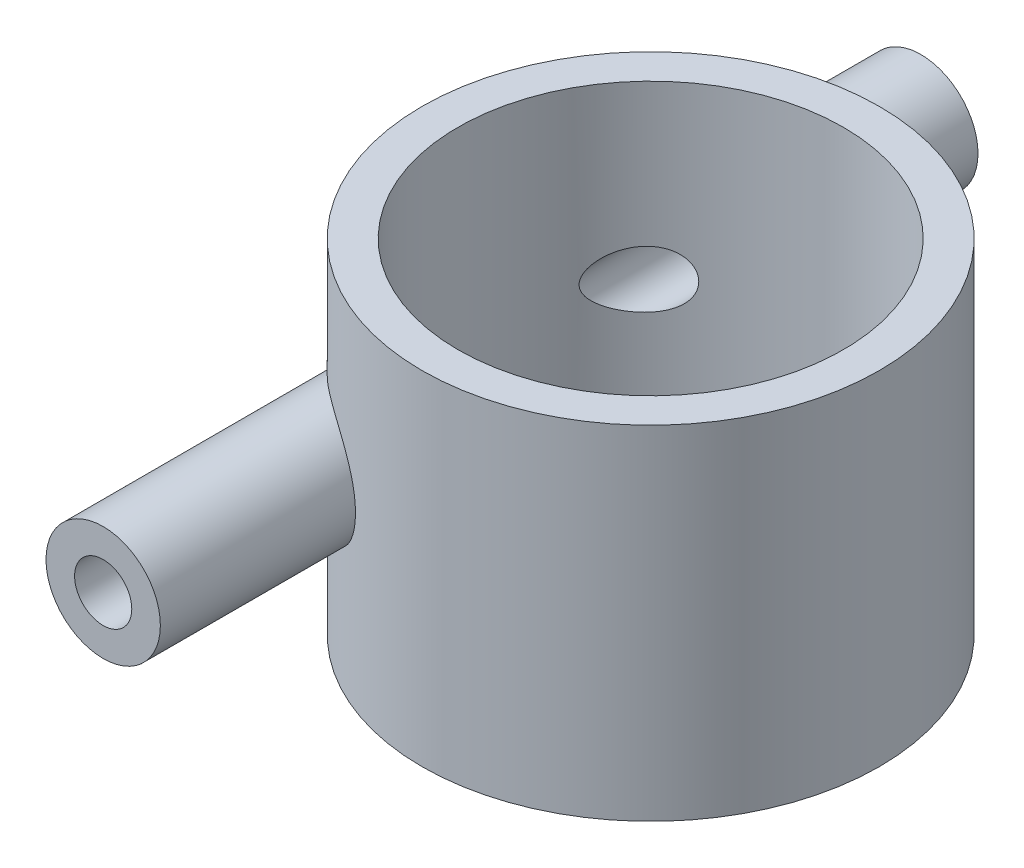
ISO-10303-21;
HEADER;
FILE_DESCRIPTION(('STEP AP214'),'2;1');
FILE_NAME('part.step','',(''),(''),'','','');
FILE_SCHEMA(('AUTOMOTIVE_DESIGN { 1 0 10303 214 1 1 1 1 }'));
ENDSEC;
DATA;
#1=APPLICATION_CONTEXT('core data for automotive mechanical design processes');
#2=APPLICATION_PROTOCOL_DEFINITION('international standard','automotive_design',2000,#1);
#3=PRODUCT_CONTEXT('',#1,'mechanical');
#4=PRODUCT('Part','Part','',(#3));
#5=PRODUCT_RELATED_PRODUCT_CATEGORY('part','',(#4));
#6=PRODUCT_DEFINITION_FORMATION('','',#4);
#7=PRODUCT_DEFINITION_CONTEXT('part definition',#1,'design');
#8=PRODUCT_DEFINITION('design','',#6,#7);
#9=PRODUCT_DEFINITION_SHAPE('','',#8);
#10=(LENGTH_UNIT() NAMED_UNIT(*) SI_UNIT(.MILLI.,.METRE.));
#11=(NAMED_UNIT(*) PLANE_ANGLE_UNIT() SI_UNIT($,.RADIAN.));
#12=(NAMED_UNIT(*) SI_UNIT($,.STERADIAN.) SOLID_ANGLE_UNIT());
#13=UNCERTAINTY_MEASURE_WITH_UNIT(LENGTH_MEASURE(1.E-05),#10,'distance_accuracy_value','');
#14=(GEOMETRIC_REPRESENTATION_CONTEXT(3) GLOBAL_UNCERTAINTY_ASSIGNED_CONTEXT((#13)) GLOBAL_UNIT_ASSIGNED_CONTEXT((#10,
#11,#12)) REPRESENTATION_CONTEXT('',''));
#15=CARTESIAN_POINT('',(0.,0.,0.));
#16=DIRECTION('',(0.,0.,1.));
#17=DIRECTION('',(1.,0.,0.));
#18=AXIS2_PLACEMENT_3D('',#15,#16,#17);
#19=CARTESIAN_POINT('',(0.,2.,0.));
#20=DIRECTION('',(0.,1.,0.));
#21=DIRECTION('',(0.,0.,1.));
#22=AXIS2_PLACEMENT_3D('',#19,#20,#21);
#23=CYLINDRICAL_SURFACE('',#22,10.7);
#24=CARTESIAN_POINT('',(-6.1125,9.525,8.78221747339474));
#25=CARTESIAN_POINT('',(-6.11250312254416,9.44825700080973,8.78221600533207));
#26=CARTESIAN_POINT('',(-6.118097707077,9.37148095001925,8.77832952546134));
#27=CARTESIAN_POINT('',(-6.14014624439313,9.2202680872524,8.76292057863401));
#28=CARTESIAN_POINT('',(-6.15660823273063,9.14583304896233,8.75139246128695));
#29=CARTESIAN_POINT('',(-6.19936098052003,9.00166951688379,8.72115814971002));
#30=CARTESIAN_POINT('',(-6.22562073033161,8.93192698485165,8.70247459734718));
#31=CARTESIAN_POINT('',(-6.28658154592039,8.79850895554664,8.65853903094098));
#32=CARTESIAN_POINT('',(-6.32128301684507,8.73483374966998,8.63328670163521));
#33=CARTESIAN_POINT('',(-6.3994598224086,8.61157622307415,8.57551064924828));
#34=CARTESIAN_POINT('',(-6.44328938104205,8.55236226492112,8.54268444189073));
#35=CARTESIAN_POINT('',(-6.53664661414861,8.44242114720817,8.47146442230904));
#36=CARTESIAN_POINT('',(-6.5861772633967,8.39169845249712,8.43306770069741));
#37=CARTESIAN_POINT('',(-6.71110319278224,8.27921485046292,8.3342538351227));
#38=CARTESIAN_POINT('',(-6.7885680721469,8.22187775658926,8.27139799755292));
#39=CARTESIAN_POINT('',(-6.94762084216152,8.12398507888238,8.13826727499792));
#40=CARTESIAN_POINT('',(-7.02921628051588,8.0834615586283,8.06797853267598));
#41=CARTESIAN_POINT('',(-7.22022952487831,8.00720148456525,7.8980643946847));
#42=CARTESIAN_POINT('',(-7.33007886489237,7.97729137827179,7.7963237898771));
#43=CARTESIAN_POINT('',(-7.54730108217441,7.94101684850117,7.58624966738823));
#44=CARTESIAN_POINT('',(-7.6546702976711,7.93468527287175,7.47790716569245));
#45=CARTESIAN_POINT('',(-7.82695206498514,7.94114427042855,7.29647069996284));
#46=CARTESIAN_POINT('',(-7.89339800652879,7.94794116341055,7.22452664697531));
#47=CARTESIAN_POINT('',(-8.02372055856718,7.96945394763684,7.07950553234341));
#48=CARTESIAN_POINT('',(-8.08759739126862,7.98416915242275,7.00642856944711));
#49=CARTESIAN_POINT('',(-8.21252985475377,8.02109835439512,6.85956767343639));
#50=CARTESIAN_POINT('',(-8.27358077957587,8.04332438218939,6.78578279179522));
#51=CARTESIAN_POINT('',(-8.39246382300987,8.09501697285372,6.63818671460316));
#52=CARTESIAN_POINT('',(-8.45029689335531,8.12448138074113,6.56437553340099));
#53=CARTESIAN_POINT('',(-8.55162512357,8.18423605307258,6.43158405370999));
#54=CARTESIAN_POINT('',(-8.59572945668235,8.21326358615959,6.37249731536299));
#55=CARTESIAN_POINT('',(-8.68150400754895,8.27614673141504,6.25513919448376));
#56=CARTESIAN_POINT('',(-8.72317472840425,8.31000134066538,6.1968676453351));
#57=CARTESIAN_POINT('',(-8.80374737377532,8.38270627402089,6.08185385469353));
#58=CARTESIAN_POINT('',(-8.84265725425359,8.42154125548262,6.0251075381991));
#59=CARTESIAN_POINT('',(-8.9175006003756,8.50471678579894,5.91376983766213));
#60=CARTESIAN_POINT('',(-8.95343632300431,8.54905309482773,5.85917683632136));
#61=CARTESIAN_POINT('',(-9.02013077288391,8.64154219394611,5.75593814489387));
#62=CARTESIAN_POINT('',(-9.05105914715668,8.6893899644181,5.70713138272459));
#63=CARTESIAN_POINT('',(-9.10910347717043,8.79149331197321,5.61402109706938));
#64=CARTESIAN_POINT('',(-9.13621987473754,8.84574814510394,5.56971705186243));
#65=CARTESIAN_POINT('',(-9.18136319412692,8.95187692903849,5.49492078927352));
#66=CARTESIAN_POINT('',(-9.2001517187026,9.0026560875438,5.46335636648559));
#67=CARTESIAN_POINT('',(-9.23314945339901,9.10941583542776,5.40740294007257));
#68=CARTESIAN_POINT('',(-9.24736881331456,9.16538453523171,5.3829980431617));
#69=CARTESIAN_POINT('',(-9.26703909950302,9.26710962039738,5.34904410110054));
#70=CARTESIAN_POINT('',(-9.2737980449472,9.31186983476457,5.33729902106589));
#71=CARTESIAN_POINT('',(-9.28346806398171,9.40302460875686,5.32046221755713));
#72=CARTESIAN_POINT('',(-9.28638341250137,9.44941729362729,5.31536310237331));
#73=CARTESIAN_POINT('',(-9.28808795320677,9.54264689305431,5.31238423611888));
#74=CARTESIAN_POINT('',(-9.28686571701582,9.58948468109958,5.31452448079022));
#75=CARTESIAN_POINT('',(-9.28039769296681,9.68202717332728,5.32581054490924));
#76=CARTESIAN_POINT('',(-9.27514844440529,9.72773086800803,5.33496238992403));
#77=CARTESIAN_POINT('',(-9.25940765953809,9.82754091658898,5.36224468478533));
#78=CARTESIAN_POINT('',(-9.24796330665905,9.8810460839269,5.38199784110397));
#79=CARTESIAN_POINT('',(-9.22072094100505,9.98369439393398,5.42853878586149));
#80=CARTESIAN_POINT('',(-9.20491384100954,10.0328281457153,5.45534125185065));
#81=CARTESIAN_POINT('',(-9.15960102465871,10.154343513761,5.53124025011146));
#82=CARTESIAN_POINT('',(-9.12751538791479,10.2233392309158,5.58416069773472));
#83=CARTESIAN_POINT('',(-9.05732531208008,10.3515500580938,5.69730946058455));
#84=CARTESIAN_POINT('',(-9.01920400539126,10.4107367772001,5.75755814292592));
#85=CARTESIAN_POINT('',(-8.9431479687853,10.5141092085981,5.87489591990046));
#86=CARTESIAN_POINT('',(-8.90573580170766,10.5592423855958,5.93150161825949));
#87=CARTESIAN_POINT('',(-8.8277949582927,10.6437228259516,6.0468908780888));
#88=CARTESIAN_POINT('',(-8.78726404241096,10.6830658712959,6.1056759885785));
#89=CARTESIAN_POINT('',(-8.70341128194668,10.7564323368033,6.22462314422241));
#90=CARTESIAN_POINT('',(-8.66008738284675,10.7904517763991,6.28478618151327));
#91=CARTESIAN_POINT('',(-8.57088690693405,10.8534175632849,6.40590036528584));
#92=CARTESIAN_POINT('',(-8.52500932149388,10.8823618870588,6.46685181576511));
#93=CARTESIAN_POINT('',(-8.4278455769129,10.9369843794155,6.5930384921221));
#94=CARTESIAN_POINT('',(-8.37640146480905,10.9623309492211,6.65829618409498));
#95=CARTESIAN_POINT('',(-8.27101973585621,11.0073548811838,6.78876176113054));
#96=CARTESIAN_POINT('',(-8.21708126092354,11.027030275314,6.85396962109007));
#97=CARTESIAN_POINT('',(-8.05190316100218,11.0772787844189,7.04880876992144));
#98=CARTESIAN_POINT('',(-7.93713508422537,11.0991676046229,7.1778719923353));
#99=CARTESIAN_POINT('',(-7.71432124606716,11.1158896481952,7.41638392815298));
#100=CARTESIAN_POINT('',(-7.60705500820879,11.1135832560016,7.52636343095351));
#101=CARTESIAN_POINT('',(-7.38934936587115,11.0856604051313,7.7401966325925));
#102=CARTESIAN_POINT('',(-7.27891382487403,11.0600712499003,7.84405735499491));
#103=CARTESIAN_POINT('',(-7.08616854910444,10.9916608224517,8.01802604447975));
#104=CARTESIAN_POINT('',(-7.00362831784109,10.9546332703483,8.0901484217593));
#105=CARTESIAN_POINT('',(-6.84193587057706,10.8638237702846,8.22733767400388));
#106=CARTESIAN_POINT('',(-6.7627789364571,10.8100660818133,8.29241458223543));
#107=CARTESIAN_POINT('',(-6.6263955948596,10.6970806161976,8.40160656609692));
#108=CARTESIAN_POINT('',(-6.56789998950395,10.6409556794284,8.44733597540694));
#109=CARTESIAN_POINT('',(-6.45807967617888,10.51727876038,8.5315878348748));
#110=CARTESIAN_POINT('',(-6.40675468648985,10.4497272272604,8.57011056818916));
#111=CARTESIAN_POINT('',(-6.31374370884703,10.3034746614968,8.63886735272607));
#112=CARTESIAN_POINT('',(-6.27214443072115,10.224682721787,8.66902725647348));
#113=CARTESIAN_POINT('',(-6.20214042060768,10.0585309701233,8.71925090265529));
#114=CARTESIAN_POINT('',(-6.17371041969858,9.9711879593402,8.73933398648695));
#115=CARTESIAN_POINT('',(-6.1396491694644,9.82334868274917,8.763273516929));
#116=CARTESIAN_POINT('',(-6.12950440946064,9.76436807465903,8.77036159249388));
#117=CARTESIAN_POINT('',(-6.11592920250131,9.6452649397998,8.77983372469339));
#118=CARTESIAN_POINT('',(-6.1124975528975,9.58514261951655,8.78221862389884));
#119=CARTESIAN_POINT('',(-6.1125,9.525,8.78221747339474));
#120=B_SPLINE_CURVE_WITH_KNOTS('',3,(#24,#25,#26,#27,#28,#29,#30,#31,#32,#33,#34,#35,#36,#37,
#38,#39,#40,#41,#42,#43,#44,#45,#46,#47,#48,#49,#50,#51,#52,#53,#54,#55,#56,#57,#58,#59,#60,#61,
#62,#63,#64,#65,#66,#67,#68,#69,#70,#71,#72,#73,#74,#75,#76,#77,#78,#79,#80,#81,#82,#83,#84,#85,
#86,#87,#88,#89,#90,#91,#92,#93,#94,#95,#96,#97,#98,#99,#100,#101,#102,#103,#104,#105,#106,#107,
#108,#109,#110,#111,#112,#113,#114,#115,#116,#117,#118,#119),.UNSPECIFIED.,.T.,.F.,(4,2,2,2,2,2,
2,2,2,2,2,2,2,2,2,2,2,2,2,2,2,2,2,2,2,2,2,2,2,2,2,2,2,2,2,2,2,2,2,2,2,2,2,2,2,2,2,4),(0.,
0.229991610309302,0.460153471325746,0.68959297192278,0.919043486290329,1.16006563841501,
1.40121412865386,1.74449857515124,2.08843469107282,2.54404377998085,3.00028735249987,
3.2944629407276,3.58861303024036,3.8832365314666,4.17777242459176,4.41532250201555,
4.65282329555887,4.88960926581523,5.12621386761198,5.3508922367212,5.57554454303554,
5.76297689918269,5.94998997376385,6.08971574879399,6.22928598640786,6.36924204360636,
6.50931851010117,6.68286055069853,6.85676682822766,7.1332712001953,7.41056240748141,
7.65470249878657,7.89901957092658,8.14351845986203,8.38811461317236,8.64850524821871,
8.90898613624583,9.42909110591008,9.88847380995331,10.3473184941903,10.6931940698953,
11.0385704282666,11.3167024960362,11.5948236334601,11.8753370994694,12.1553100697703,
12.3355841895311,12.5158260103718),.UNSPECIFIED.);
#121=CARTESIAN_POINT('',(-6.1125,9.525,8.78221747339474));
#122=VERTEX_POINT('',#121);
#123=EDGE_CURVE('E64',#122,#122,#120,.T.);
#124=ORIENTED_EDGE('',*,*,#123,.F.);
#125=EDGE_LOOP('',(#124));
#126=FACE_BOUND('',#125,.T.);
#127=CARTESIAN_POINT('',(0.,2.,0.));
#128=DIRECTION('',(0.,1.,0.));
#129=DIRECTION('',(0.,0.,1.));
#130=AXIS2_PLACEMENT_3D('',#127,#128,#129);
#131=CIRCLE('',#130,10.7);
#132=CARTESIAN_POINT('',(0.,2.,10.7));
#133=VERTEX_POINT('',#132);
#134=EDGE_CURVE('E51',#133,#133,#131,.T.);
#135=ORIENTED_EDGE('',*,*,#134,.F.);
#136=EDGE_LOOP('',(#135));
#137=FACE_BOUND('',#136,.T.);
#138=CARTESIAN_POINT('',(0.,19.05,0.));
#139=DIRECTION('',(0.,1.,0.));
#140=DIRECTION('',(0.,0.,1.));
#141=AXIS2_PLACEMENT_3D('',#138,#139,#140);
#142=CIRCLE('',#141,10.7);
#143=CARTESIAN_POINT('',(0.,19.05,10.7));
#144=VERTEX_POINT('',#143);
#145=EDGE_CURVE('E53',#144,#144,#142,.T.);
#146=ORIENTED_EDGE('',*,*,#145,.T.);
#147=EDGE_LOOP('',(#146));
#148=FACE_BOUND('',#147,.T.);
#149=CARTESIAN_POINT('',(-9.2875,9.525,-5.3134116864779));
#150=CARTESIAN_POINT('',(-9.28749909700028,9.57320846355984,-5.31341344549333));
#151=CARTESIAN_POINT('',(-9.28528200855449,9.62142339686158,-5.31729418672118));
#152=CARTESIAN_POINT('',(-9.27665222647446,9.71632113073812,-5.3323347948109));
#153=CARTESIAN_POINT('',(-9.27023459341105,9.76300205952093,-5.3435032312413));
#154=CARTESIAN_POINT('',(-9.25160556435596,9.86569210680108,-5.37570628912406));
#155=CARTESIAN_POINT('',(-9.23831394431524,9.92092336158361,-5.39856381124748));
#156=CARTESIAN_POINT('',(-9.20722745066015,10.0264632181994,-5.45141326984483));
#157=CARTESIAN_POINT('',(-9.18942273834044,10.0767607276663,-5.48142078487832));
#158=CARTESIAN_POINT('',(-9.13812457741876,10.2025296199306,-5.56672559187901));
#159=CARTESIAN_POINT('',(-9.10178873413296,10.2740407916971,-5.62609224225675));
#160=CARTESIAN_POINT('',(-9.02269407635274,10.4062409191781,-5.75209404339935));
#161=CARTESIAN_POINT('',(-8.97991754466635,10.4668989800182,-5.81874910032068));
#162=CARTESIAN_POINT('',(-8.89529523261613,10.5715780340549,-5.94717124002266));
#163=CARTESIAN_POINT('',(-8.85406579619175,10.6167378227935,-6.00842965726724));
#164=CARTESIAN_POINT('',(-8.76828901880866,10.7008080062415,-6.13292985420053));
#165=CARTESIAN_POINT('',(-8.72373941141337,10.7397140737327,-6.19617297132949));
#166=CARTESIAN_POINT('',(-8.63163764008952,10.8117106372315,-6.32384649380383));
#167=CARTESIAN_POINT('',(-8.58408317003613,10.8447965909825,-6.38827778350317));
#168=CARTESIAN_POINT('',(-8.48621682472517,10.9053372814169,-6.51772307243879));
#169=CARTESIAN_POINT('',(-8.43590388113192,10.9327898165175,-6.58273728916715));
#170=CARTESIAN_POINT('',(-8.33004515366144,10.9833603698089,-6.71624652803568));
#171=CARTESIAN_POINT('',(-8.27436331018422,11.0061801350169,-6.78474737846111));
#172=CARTESIAN_POINT('',(-8.16039472037529,11.0454695479479,-6.92140921265122));
#173=CARTESIAN_POINT('',(-8.10210697030871,11.0619367248721,-6.9895700540181));
#174=CARTESIAN_POINT('',(-7.92383710779238,11.1013434593197,-7.19270803876774));
#175=CARTESIAN_POINT('',(-7.80020062587252,11.1144079207638,-7.32665453654917));
#176=CARTESIAN_POINT('',(-7.57350893650474,11.1105985385014,-7.55993335767987));
#177=CARTESIAN_POINT('',(-7.47167385735322,11.0995047855243,-7.66056520446856));
#178=CARTESIAN_POINT('',(-7.26645067797701,11.0557401240879,-7.85548086100746));
#179=CARTESIAN_POINT('',(-7.1630646746404,11.0230961625032,-7.94977243674193));
#180=CARTESIAN_POINT('',(-6.98237900630841,10.943643649066,-8.10847657862885));
#181=CARTESIAN_POINT('',(-6.90454954150497,10.9018210937308,-8.17477270274738));
#182=CARTESIAN_POINT('',(-6.75322501268718,10.8024727039073,-8.30021422762753));
#183=CARTESIAN_POINT('',(-6.67972439808192,10.7449675357979,-8.35936889235139));
#184=CARTESIAN_POINT('',(-6.55370008590629,10.6260001539683,-8.45838160470373));
#185=CARTESIAN_POINT('',(-6.49981868078842,10.5672680579546,-8.49978180871949));
#186=CARTESIAN_POINT('',(-6.39977017313746,10.439404910803,-8.5753640881991));
#187=CARTESIAN_POINT('',(-6.35360103612853,10.3702766113288,-8.60954806791332));
#188=CARTESIAN_POINT('',(-6.2712754796623,10.222226212575,-8.66970230164679));
#189=CARTESIAN_POINT('',(-6.23519483887798,10.143236117106,-8.6956105899733));
#190=CARTESIAN_POINT('',(-6.17601894750503,9.97810976442035,-8.73774170715943));
#191=CARTESIAN_POINT('',(-6.15291382492405,9.89197899736234,-8.75397189985967));
#192=CARTESIAN_POINT('',(-6.12348579868909,9.72712057199748,-8.77457679693773));
#193=CARTESIAN_POINT('',(-6.11538906613408,9.64886224062953,-8.78020610643345));
#194=CARTESIAN_POINT('',(-6.11090743717547,9.491863295921,-8.78332639281494));
#195=CARTESIAN_POINT('',(-6.114517327391,9.41312291284471,-8.78082099237951));
#196=CARTESIAN_POINT('',(-6.13260695874546,9.26267993401663,-8.76819460605917));
#197=CARTESIAN_POINT('',(-6.14638034657922,9.19084834955119,-8.75856840605044));
#198=CARTESIAN_POINT('',(-6.18322022816436,9.05089898604887,-8.7325993561211));
#199=CARTESIAN_POINT('',(-6.20628683480627,8.98278125213786,-8.7162564246081));
#200=CARTESIAN_POINT('',(-6.26141965251207,8.8497275229175,-8.67673916510231));
#201=CARTESIAN_POINT('',(-6.29374702853306,8.7849599024775,-8.65336542980736));
#202=CARTESIAN_POINT('',(-6.36554764515263,8.66218036608679,-8.60068506188604));
#203=CARTESIAN_POINT('',(-6.4050231320863,8.60417058326984,-8.57137656388286));
#204=CARTESIAN_POINT('',(-6.49426004531613,8.48953219883286,-8.50400118954703));
#205=CARTESIAN_POINT('',(-6.54467735636565,8.4337765965368,-8.46532246617391));
#206=CARTESIAN_POINT('',(-6.6503743990676,8.33174791594585,-8.38254414047693));
#207=CARTESIAN_POINT('',(-6.70565721686376,8.28548091903992,-8.33844109040399));
#208=CARTESIAN_POINT('',(-6.84628661340174,8.18257780565605,-8.22374391982187));
#209=CARTESIAN_POINT('',(-6.93347787901452,8.13139903017803,-8.1504915202301));
#210=CARTESIAN_POINT('',(-7.11037032379864,8.04780361432811,-7.99665460746943));
#211=CARTESIAN_POINT('',(-7.20007644731637,8.01542711455131,-7.91605482956057));
#212=CARTESIAN_POINT('',(-7.40887500987139,7.95954067322512,-7.72172454143991));
#213=CARTESIAN_POINT('',(-7.52778246456278,7.94259671939798,-7.60591484478024));
#214=CARTESIAN_POINT('',(-7.76037060040392,7.93437391932993,-7.36847583326457));
#215=CARTESIAN_POINT('',(-7.87404582312013,7.9431212851652,-7.24684069940213));
#216=CARTESIAN_POINT('',(-8.0964446126703,7.9835515311579,-6.99757744342968));
#217=CARTESIAN_POINT('',(-8.20498758882515,8.01577173189359,-6.86987562267853));
#218=CARTESIAN_POINT('',(-8.36059469893279,8.08038223119728,-6.67811935601818));
#219=CARTESIAN_POINT('',(-8.41128321297672,8.10464668706154,-6.61413849710046));
#220=CARTESIAN_POINT('',(-8.51009722783389,8.15859416373662,-6.48650591366426));
#221=CARTESIAN_POINT('',(-8.55822320237628,8.18827617849527,-6.4228541302888));
#222=CARTESIAN_POINT('',(-8.6810691496704,8.27349581221807,-6.25662424606581));
#223=CARTESIAN_POINT('',(-8.75356546958424,8.33358331035333,-6.15463650926948));
#224=CARTESIAN_POINT('',(-8.85582351554727,8.43571938485868,-6.00566758559574));
#225=CARTESIAN_POINT('',(-8.8888111647117,8.47174112839451,-5.95670735342705));
#226=CARTESIAN_POINT('',(-8.95238707539297,8.54819085478235,-5.86072237447699));
#227=CARTESIAN_POINT('',(-8.98297670781712,8.58861628805749,-5.81369652925542));
#228=CARTESIAN_POINT('',(-9.04443287066973,8.67886465017437,-5.71767525582059));
#229=CARTESIAN_POINT('',(-9.07499493618649,8.72922806082286,-5.66898671062884));
#230=CARTESIAN_POINT('',(-9.13187263176037,8.83681794313576,-5.57690024363204));
#231=CARTESIAN_POINT('',(-9.15819218785842,8.89403798313259,-5.53349743957561));
#232=CARTESIAN_POINT('',(-9.19947188535139,9.00136243466387,-5.46451537888659));
#233=CARTESIAN_POINT('',(-9.21564000780763,9.04984350718975,-5.43716378444928));
#234=CARTESIAN_POINT('',(-9.24375392045634,9.15119604276477,-5.38922877231426));
#235=CARTESIAN_POINT('',(-9.25570799967413,9.20405863137848,-5.36863207335947));
#236=CARTESIAN_POINT('',(-9.27229421679501,9.30154129912676,-5.33992282611117));
#237=CARTESIAN_POINT('',(-9.27795123864683,9.34546810508243,-5.33007287574056));
#238=CARTESIAN_POINT('',(-9.28555303828786,9.43459542477924,-5.31681911250488));
#239=CARTESIAN_POINT('',(-9.28750084674389,9.47979486802111,-5.31341003704711));
#240=CARTESIAN_POINT('',(-9.2875,9.525,-5.3134116864779));
#241=B_SPLINE_CURVE_WITH_KNOTS('',3,(#149,#150,#151,#152,#153,#154,#155,#156,#157,#158,#159,
#160,#161,#162,#163,#164,#165,#166,#167,#168,#169,#170,#171,#172,#173,#174,#175,#176,#177,#178,
#179,#180,#181,#182,#183,#184,#185,#186,#187,#188,#189,#190,#191,#192,#193,#194,#195,#196,#197,
#198,#199,#200,#201,#202,#203,#204,#205,#206,#207,#208,#209,#210,#211,#212,#213,#214,#215,#216,
#217,#218,#219,#220,#221,#222,#223,#224,#225,#226,#227,#228,#229,#230,#231,#232,#233,#234,#235,
#236,#237,#238,#239,#240),.UNSPECIFIED.,.T.,.F.,(4,2,2,2,2,2,2,2,2,2,2,2,2,2,2,2,2,2,2,2,2,2,2,
2,2,2,2,2,2,2,2,2,2,2,2,2,2,2,2,2,2,2,2,2,2,4),(0.,0.144442931093282,0.289056018815975,
0.471724225604942,0.654794133083839,0.95250777597823,1.25105586653063,1.51037280450372,
1.76986840968694,2.02956564598811,2.28936418146001,2.56262257065281,2.83598713505578,
3.38147620373538,3.81086666236054,4.2397212157374,4.56992048201119,4.89968670046494,
5.16805582577805,5.43635404384364,5.70661649923462,5.97667305486913,6.21205644019734,
6.44733501522172,6.66764096517127,6.88794959139512,7.11521444518335,7.34255084260221,
7.595200381551,7.84801134477742,8.2204825892446,8.59374611918711,9.09159107900928,
9.58994415137214,10.1000785886785,10.3553704383494,10.6106149279296,11.02573403466,
11.2330527125447,11.4402519920308,11.6690817113517,11.8976984393873,12.0710534393288,
12.2440655218357,12.3796206300842,12.5150649334561),.UNSPECIFIED.);
#242=CARTESIAN_POINT('',(-9.2875,9.525,-5.3134116864779));
#243=VERTEX_POINT('',#242);
#244=EDGE_CURVE('E101',#243,#243,#241,.T.);
#245=ORIENTED_EDGE('',*,*,#244,.T.);
#246=EDGE_LOOP('',(#245));
#247=FACE_BOUND('',#246,.T.);
#248=ADVANCED_FACE('F31',(#126,#137,#148,#247),#23,.F.);
#249=CARTESIAN_POINT('',(0.,19.05,0.));
#250=DIRECTION('',(0.,-1.,0.));
#251=DIRECTION('',(0.,0.,-1.));
#252=AXIS2_PLACEMENT_3D('',#249,#250,#251);
#253=CYLINDRICAL_SURFACE('',#252,12.7);
#254=CARTESIAN_POINT('',(-10.875,9.525,-6.55929683731419));
#255=CARTESIAN_POINT('',(-10.8749923158783,9.42437113470074,-6.55931225869769));
#256=CARTESIAN_POINT('',(-10.8701623824061,9.32364809312654,-6.56733796402152));
#257=CARTESIAN_POINT('',(-10.8513361215272,9.12538860548623,-6.59839417033196));
#258=CARTESIAN_POINT('',(-10.8373222583938,9.02785863104439,-6.62145337573413));
#259=CARTESIAN_POINT('',(-10.7962750476039,8.81156288838932,-6.68822546454939));
#260=CARTESIAN_POINT('',(-10.7666890945438,8.69453536132844,-6.73592226908898));
#261=CARTESIAN_POINT('',(-10.6971832298657,8.4708021209759,-6.84576336985911));
#262=CARTESIAN_POINT('',(-10.6572395044645,8.36412098230888,-6.90794092509557));
#263=CARTESIAN_POINT('',(-10.577191933568,8.17942268030136,-7.02974629146747));
#264=CARTESIAN_POINT('',(-10.5384444562901,8.09972524278021,-7.08777294306931));
#265=CARTESIAN_POINT('',(-10.4562052222223,7.94654457874846,-7.20854423597185));
#266=CARTESIAN_POINT('',(-10.4127104471733,7.87306535900553,-7.27129187083357));
#267=CARTESIAN_POINT('',(-10.3214625569844,7.73177885663233,-7.40024758028414));
#268=CARTESIAN_POINT('',(-10.273702123578,7.66398172401841,-7.4664615179839));
#269=CARTESIAN_POINT('',(-10.1743480943273,7.53378658531147,-7.60129353358626));
#270=CARTESIAN_POINT('',(-10.1227533816064,7.47139016392432,-7.66991230888737));
#271=CARTESIAN_POINT('',(-9.98852747048543,7.32090573714262,-7.8445453053421));
#272=CARTESIAN_POINT('',(-9.90358461757055,7.23611458192195,-7.95163694430193));
#273=CARTESIAN_POINT('',(-9.72610925354681,7.07762214797219,-8.16776498517048));
#274=CARTESIAN_POINT('',(-9.63357327576782,7.00392597871747,-8.2768022573876));
#275=CARTESIAN_POINT('',(-9.44125699709732,6.86745234472695,-8.49552167442723));
#276=CARTESIAN_POINT('',(-9.34147061260625,6.80468420288782,-8.60520428814393));
#277=CARTESIAN_POINT('',(-9.13509275385992,6.69038484760461,-8.82398405109529));
#278=CARTESIAN_POINT('',(-9.02850247283751,6.63885167079071,-8.93308129937011));
#279=CARTESIAN_POINT('',(-8.80768627000083,6.54706391688662,-9.15089983862231));
#280=CARTESIAN_POINT('',(-8.69339018603612,6.50693746154616,-9.25960427749726));
#281=CARTESIAN_POINT('',(-8.45870689433995,6.43956716104754,-9.47447071293546));
#282=CARTESIAN_POINT('',(-8.33831867055252,6.41232547272065,-9.58063228101607));
#283=CARTESIAN_POINT('',(-8.09247991046914,6.37189808371629,-9.7891601363094));
#284=CARTESIAN_POINT('',(-7.96704257192864,6.35867793095868,-9.89153512668208));
#285=CARTESIAN_POINT('',(-7.71199191824761,6.34745576064558,-10.0916547439251));
#286=CARTESIAN_POINT('',(-7.58238089795565,6.34944551771383,-10.1894018447394));
#287=CARTESIAN_POINT('',(-7.27489181260224,6.37363042069145,-10.4121620608343));
#288=CARTESIAN_POINT('',(-7.09579693264374,6.40256341878735,-10.5349394399073));
#289=CARTESIAN_POINT('',(-6.82733725834174,6.4708813391105,-10.7092941508392));
#290=CARTESIAN_POINT('',(-6.73785123932375,6.49782023372307,-10.7657944173647));
#291=CARTESIAN_POINT('',(-6.55973731021087,6.56032144804005,-10.8752346433694));
#292=CARTESIAN_POINT('',(-6.47110899872342,6.5958795087884,-10.9281763447771));
#293=CARTESIAN_POINT('',(-6.29486750456606,6.67619517533712,-11.0306452283555));
#294=CARTESIAN_POINT('',(-6.20726990614152,6.72103027449779,-11.0801386218913));
#295=CARTESIAN_POINT('',(-6.03500208328506,6.81977252290763,-11.1749007297519));
#296=CARTESIAN_POINT('',(-5.95033040934049,6.87367510011989,-11.2201715554013));
#297=CARTESIAN_POINT('',(-5.78505218038248,6.9904711382433,-11.3062750234925));
#298=CARTESIAN_POINT('',(-5.70444458570551,7.05336228377001,-11.3471088041286));
#299=CARTESIAN_POINT('',(-5.54848205538688,7.18786629750104,-11.4241810585892));
#300=CARTESIAN_POINT('',(-5.47312623182853,7.25947768572232,-11.4604203100633));
#301=CARTESIAN_POINT('',(-5.33850867924445,7.40080704120019,-11.523675542778));
#302=CARTESIAN_POINT('',(-5.27844201857348,7.46949885853219,-11.5512768952777));
#303=CARTESIAN_POINT('',(-5.16389257435789,7.61262340748327,-11.6029375861623));
#304=CARTESIAN_POINT('',(-5.10940909711345,7.68705542387469,-11.6269973647436));
#305=CARTESIAN_POINT('',(-5.00673480889106,7.84110346910587,-11.6715783958034));
#306=CARTESIAN_POINT('',(-4.95854156242714,7.92071747355419,-11.6921010188095));
#307=CARTESIAN_POINT('',(-4.86905385634508,8.08448250324203,-11.7296488792456));
#308=CARTESIAN_POINT('',(-4.82775898603105,8.1686332579906,-11.7466743248945));
#309=CARTESIAN_POINT('',(-4.72186961874337,8.41124979562487,-11.7898026152302));
#310=CARTESIAN_POINT('',(-4.66579690821175,8.57427025012278,-11.8119600659574));
#311=CARTESIAN_POINT('',(-4.58072172555861,8.90819440527527,-11.8452141778375));
#312=CARTESIAN_POINT('',(-4.55171268164638,9.07909618154819,-11.8563135242417));
#313=CARTESIAN_POINT('',(-4.52236382560552,9.4184362801219,-11.8675381030273));
#314=CARTESIAN_POINT('',(-4.52117549053815,9.58679043140194,-11.8679881406574));
#315=CARTESIAN_POINT('',(-4.5453682567852,9.92128368418757,-11.8587432930424));
#316=CARTESIAN_POINT('',(-4.57074746960954,10.0874229422834,-11.8490491288734));
#317=CARTESIAN_POINT('',(-4.64687138529173,10.4119438396442,-11.8194003956414));
#318=CARTESIAN_POINT('',(-4.69748960426577,10.5703598805401,-11.799496975552));
#319=CARTESIAN_POINT('',(-4.82201398489581,10.8759418454647,-11.7491558835984));
#320=CARTESIAN_POINT('',(-4.89591947408404,11.0231080942018,-11.718718515921));
#321=CARTESIAN_POINT('',(-5.06502101442777,11.3039538415673,-11.6466332854418));
#322=CARTESIAN_POINT('',(-5.16044632630772,11.4374637621251,-11.6048636417966));
#323=CARTESIAN_POINT('',(-5.36827172644991,11.686000634992,-11.5101984654264));
#324=CARTESIAN_POINT('',(-5.48067341812878,11.8010258393019,-11.4573018815779));
#325=CARTESIAN_POINT('',(-5.722889587217,12.0147328719734,-11.3383161222281));
#326=CARTESIAN_POINT('',(-5.85321835708038,12.1125840977182,-11.271786401036));
#327=CARTESIAN_POINT('',(-6.12272083734171,12.2851544548152,-11.1276975313587));
#328=CARTESIAN_POINT('',(-6.26189700283795,12.3598671312916,-11.0501353139687));
#329=CARTESIAN_POINT('',(-6.55759157992548,12.4921723543194,-10.8774940381186));
#330=CARTESIAN_POINT('',(-6.71453046621376,12.5475686487797,-10.7814611022913));
#331=CARTESIAN_POINT('',(-7.02882212983494,12.6325226590521,-10.5792565710941));
#332=CARTESIAN_POINT('',(-7.18617510084819,12.6620646388104,-10.4730788447064));
#333=CARTESIAN_POINT('',(-7.52233768338799,12.7002220392128,-10.2349038415352));
#334=CARTESIAN_POINT('',(-7.70059257338348,12.7047757352212,-10.1014822899296));
#335=CARTESIAN_POINT('',(-8.04875114366423,12.6856074536,-9.82634178924687));
#336=CARTESIAN_POINT('',(-8.2186535171276,12.6618810658798,-9.68462154932193));
#337=CARTESIAN_POINT('',(-8.58239519778134,12.5817299560166,-9.36496680455627));
#338=CARTESIAN_POINT('',(-8.77377936807663,12.5194901009384,-9.18567186059098));
#339=CARTESIAN_POINT('',(-9.04733661271512,12.4016659687604,-8.91360936951549));
#340=CARTESIAN_POINT('',(-9.13641783292372,12.3582130998619,-8.8222339341578));
#341=CARTESIAN_POINT('',(-9.30980777650442,12.2634122948337,-8.63905928209158));
#342=CARTESIAN_POINT('',(-9.3941176406866,12.2120662569301,-8.54726017240738));
#343=CARTESIAN_POINT('',(-9.57370526867537,12.0908865227668,-8.34600084003569));
#344=CARTESIAN_POINT('',(-9.66792003382156,12.0193998771599,-8.23658393206875));
#345=CARTESIAN_POINT('',(-9.84891257313298,11.8652861827607,-8.01928408505099));
#346=CARTESIAN_POINT('',(-9.93568570565938,11.7826522624621,-7.91140213790253));
#347=CARTESIAN_POINT('',(-10.1008628055611,11.6061169236235,-7.69938656966174));
#348=CARTESIAN_POINT('',(-10.1792976618879,11.5122600384808,-7.59524013407761));
#349=CARTESIAN_POINT('',(-10.327215666408,11.3121301942736,-7.39285218166015));
#350=CARTESIAN_POINT('',(-10.3967113909841,11.2058750888704,-7.29460247499119));
#351=CARTESIAN_POINT('',(-10.5130390276425,11.0009858748327,-7.12561929600907));
#352=CARTESIAN_POINT('',(-10.5616650197611,10.904767638374,-7.05321301072493));
#353=CARTESIAN_POINT('',(-10.650754753745,10.7022377217481,-6.91794468750378));
#354=CARTESIAN_POINT('',(-10.6912241291029,10.5959330830586,-6.85507606970308));
#355=CARTESIAN_POINT('',(-10.7568859798164,10.3887876855036,-6.75149058357974));
#356=CARTESIAN_POINT('',(-10.7834353073403,10.2893381616807,-6.70889182534406));
#357=CARTESIAN_POINT('',(-10.8272314225801,10.083582559854,-6.63798358818289));
#358=CARTESIAN_POINT('',(-10.8445043966318,9.97729674138689,-6.60963390005515));
#359=CARTESIAN_POINT('',(-10.862481080903,9.81238211682921,-6.58001798577253));
#360=CARTESIAN_POINT('',(-10.8671583322885,9.75529621246857,-6.57228334258785));
#361=CARTESIAN_POINT('',(-10.8734201973263,9.6404839350835,-6.56191801215603));
#362=CARTESIAN_POINT('',(-10.8750044104195,9.58275748007893,-6.5592879859747));
#363=CARTESIAN_POINT('',(-10.875,9.525,-6.55929683731419));
#364=B_SPLINE_CURVE_WITH_KNOTS('',3,(#254,#255,#256,#257,#258,#259,#260,#261,#262,#263,#264,
#265,#266,#267,#268,#269,#270,#271,#272,#273,#274,#275,#276,#277,#278,#279,#280,#281,#282,#283,
#284,#285,#286,#287,#288,#289,#290,#291,#292,#293,#294,#295,#296,#297,#298,#299,#300,#301,#302,
#303,#304,#305,#306,#307,#308,#309,#310,#311,#312,#313,#314,#315,#316,#317,#318,#319,#320,#321,
#322,#323,#324,#325,#326,#327,#328,#329,#330,#331,#332,#333,#334,#335,#336,#337,#338,#339,#340,
#341,#342,#343,#344,#345,#346,#347,#348,#349,#350,#351,#352,#353,#354,#355,#356,#357,#358,#359,
#360,#361,#362,#363),.UNSPECIFIED.,.T.,.F.,(4,2,2,2,2,2,2,2,2,2,2,2,2,2,2,2,2,2,2,2,2,2,2,2,2,2,
2,2,2,2,2,2,2,2,2,2,2,2,2,2,2,2,2,2,2,2,2,2,2,2,2,2,2,2,4),(0.,0.30164529012233,
0.60386822420561,0.991055706555085,1.37914139714216,1.69648652831941,2.01403461108545,
2.33213835459567,2.65033512361626,3.13222924013792,3.61434460462199,4.09686927615651,
4.57930955622904,5.06697194941655,5.55471594544314,6.04125871767173,6.52753839076477,
7.18168329076021,7.50897476751613,7.83610484946629,8.16608663278144,8.49590252747985,
8.82563361681092,9.15530882259984,9.44092179176767,9.72649923093556,10.0119657685731,
10.297415304855,10.8160364615777,11.3345316502439,11.8371915892687,12.3398158003499,
12.8399460793809,13.3400619174459,13.8457810175951,14.3515479127456,14.8774032922378,
15.4034052358055,15.9776088806555,16.5521617681051,17.2178325722819,17.8836071969665,
18.6890427202135,19.0932236007267,19.4973074315191,19.9801111458198,20.4632138461365,
20.944459495314,21.425020501367,21.8138644998411,22.2024390099356,22.5354669029648,
22.8675496787565,23.0406612007898,23.2137951398771),.UNSPECIFIED.);
#365=CARTESIAN_POINT('',(-10.875,9.525,-6.55929683731419));
#366=VERTEX_POINT('',#365);
#367=EDGE_CURVE('E95',#366,#366,#364,.T.);
#368=ORIENTED_EDGE('',*,*,#367,.T.);
#369=EDGE_LOOP('',(#368));
#370=FACE_BOUND('',#369,.T.);
#371=CARTESIAN_POINT('',(0.,0.,0.));
#372=DIRECTION('',(0.,1.,0.));
#373=DIRECTION('',(0.,0.,1.));
#374=AXIS2_PLACEMENT_3D('',#371,#372,#373);
#375=CIRCLE('',#374,12.7);
#376=CARTESIAN_POINT('',(0.,0.,12.7));
#377=VERTEX_POINT('',#376);
#378=EDGE_CURVE('E46',#377,#377,#375,.T.);
#379=ORIENTED_EDGE('',*,*,#378,.T.);
#380=EDGE_LOOP('',(#379));
#381=FACE_BOUND('',#380,.T.);
#382=CARTESIAN_POINT('',(0.,19.05,0.));
#383=DIRECTION('',(0.,1.,0.));
#384=DIRECTION('',(0.,0.,1.));
#385=AXIS2_PLACEMENT_3D('',#382,#383,#384);
#386=CIRCLE('',#385,12.7);
#387=CARTESIAN_POINT('',(0.,19.05,12.7));
#388=VERTEX_POINT('',#387);
#389=EDGE_CURVE('E42',#388,#388,#386,.T.);
#390=ORIENTED_EDGE('',*,*,#389,.F.);
#391=EDGE_LOOP('',(#390));
#392=FACE_BOUND('',#391,.T.);
#393=CARTESIAN_POINT('',(-10.875,9.525,6.55929683731419));
#394=CARTESIAN_POINT('',(-10.8749923158783,9.42437113470074,6.55931225869768));
#395=CARTESIAN_POINT('',(-10.8701623824061,9.32364809312654,6.56733796402152));
#396=CARTESIAN_POINT('',(-10.8513361215272,9.12538860548623,6.59839417033196));
#397=CARTESIAN_POINT('',(-10.8373222583938,9.02785863104439,6.62145337573414));
#398=CARTESIAN_POINT('',(-10.7962750476039,8.81156288838932,6.68822546454939));
#399=CARTESIAN_POINT('',(-10.7666890945438,8.69453536132844,6.73592226908898));
#400=CARTESIAN_POINT('',(-10.6971832298657,8.47080212097589,6.84576336985911));
#401=CARTESIAN_POINT('',(-10.6572395044645,8.36412098230888,6.90794092509558));
#402=CARTESIAN_POINT('',(-10.577191933568,8.17942268030136,7.02974629146747));
#403=CARTESIAN_POINT('',(-10.5384444562901,8.09972524278021,7.08777294306931));
#404=CARTESIAN_POINT('',(-10.4562052222223,7.94654457874846,7.20854423597185));
#405=CARTESIAN_POINT('',(-10.4127104471733,7.87306535900553,7.27129187083357));
#406=CARTESIAN_POINT('',(-10.3214625569844,7.73177885663233,7.40024758028414));
#407=CARTESIAN_POINT('',(-10.273702123578,7.6639817240184,7.4664615179839));
#408=CARTESIAN_POINT('',(-10.1743480943273,7.53378658531147,7.60129353358626));
#409=CARTESIAN_POINT('',(-10.1227533816064,7.47139016392432,7.66991230888737));
#410=CARTESIAN_POINT('',(-9.98852747048543,7.32090573714262,7.8445453053421));
#411=CARTESIAN_POINT('',(-9.90358461757055,7.23611458192195,7.95163694430193));
#412=CARTESIAN_POINT('',(-9.72610925354681,7.07762214797219,8.16776498517048));
#413=CARTESIAN_POINT('',(-9.63357327576782,7.00392597871747,8.2768022573876));
#414=CARTESIAN_POINT('',(-9.44125699709732,6.86745234472695,8.49552167442724));
#415=CARTESIAN_POINT('',(-9.34147061260625,6.80468420288782,8.60520428814393));
#416=CARTESIAN_POINT('',(-9.13509275385992,6.69038484760461,8.82398405109529));
#417=CARTESIAN_POINT('',(-9.02850247283751,6.63885167079071,8.93308129937011));
#418=CARTESIAN_POINT('',(-8.80768627000082,6.54706391688662,9.15089983862232));
#419=CARTESIAN_POINT('',(-8.69339018603612,6.50693746154616,9.25960427749726));
#420=CARTESIAN_POINT('',(-8.45870689433995,6.43956716104754,9.47447071293546));
#421=CARTESIAN_POINT('',(-8.33831867055252,6.41232547272065,9.58063228101607));
#422=CARTESIAN_POINT('',(-8.09247991046914,6.37189808371629,9.7891601363094));
#423=CARTESIAN_POINT('',(-7.96704257192864,6.35867793095868,9.89153512668208));
#424=CARTESIAN_POINT('',(-7.71199191824761,6.34745576064558,10.0916547439251));
#425=CARTESIAN_POINT('',(-7.58238089795565,6.34944551771383,10.1894018447394));
#426=CARTESIAN_POINT('',(-7.27489181260224,6.37363042069145,10.4121620608343));
#427=CARTESIAN_POINT('',(-7.09579693264374,6.40256341878735,10.5349394399073));
#428=CARTESIAN_POINT('',(-6.82733725834174,6.4708813391105,10.7092941508392));
#429=CARTESIAN_POINT('',(-6.73785123932375,6.49782023372307,10.7657944173647));
#430=CARTESIAN_POINT('',(-6.55973731021087,6.56032144804005,10.8752346433694));
#431=CARTESIAN_POINT('',(-6.47110899872342,6.5958795087884,10.9281763447771));
#432=CARTESIAN_POINT('',(-6.29486750456606,6.67619517533712,11.0306452283555));
#433=CARTESIAN_POINT('',(-6.20726990614152,6.72103027449779,11.0801386218913));
#434=CARTESIAN_POINT('',(-6.03500208328506,6.81977252290763,11.1749007297519));
#435=CARTESIAN_POINT('',(-5.95033040934049,6.87367510011988,11.2201715554013));
#436=CARTESIAN_POINT('',(-5.78505218038248,6.9904711382433,11.3062750234925));
#437=CARTESIAN_POINT('',(-5.70444458570551,7.05336228377001,11.3471088041286));
#438=CARTESIAN_POINT('',(-5.54848205538688,7.18786629750103,11.4241810585892));
#439=CARTESIAN_POINT('',(-5.47312623182853,7.25947768572232,11.4604203100633));
#440=CARTESIAN_POINT('',(-5.33850867924446,7.40080704120019,11.523675542778));
#441=CARTESIAN_POINT('',(-5.27844201857348,7.46949885853219,11.5512768952777));
#442=CARTESIAN_POINT('',(-5.16389257435789,7.61262340748327,11.6029375861623));
#443=CARTESIAN_POINT('',(-5.10940909711345,7.68705542387469,11.6269973647436));
#444=CARTESIAN_POINT('',(-5.00673480889106,7.84110346910587,11.6715783958034));
#445=CARTESIAN_POINT('',(-4.95854156242714,7.92071747355419,11.6921010188095));
#446=CARTESIAN_POINT('',(-4.86905385634508,8.08448250324203,11.7296488792456));
#447=CARTESIAN_POINT('',(-4.82775898603105,8.1686332579906,11.7466743248945));
#448=CARTESIAN_POINT('',(-4.72186961874337,8.41124979562487,11.7898026152302));
#449=CARTESIAN_POINT('',(-4.66579690821175,8.57427025012278,11.8119600659574));
#450=CARTESIAN_POINT('',(-4.58072172555861,8.90819440527527,11.8452141778375));
#451=CARTESIAN_POINT('',(-4.55171268164638,9.07909618154819,11.8563135242417));
#452=CARTESIAN_POINT('',(-4.52236382560552,9.4184362801219,11.8675381030273));
#453=CARTESIAN_POINT('',(-4.52117549053815,9.58679043140194,11.8679881406574));
#454=CARTESIAN_POINT('',(-4.5453682567852,9.92128368418757,11.8587432930424));
#455=CARTESIAN_POINT('',(-4.57074746960954,10.0874229422834,11.8490491288734));
#456=CARTESIAN_POINT('',(-4.64687138529173,10.4119438396442,11.8194003956414));
#457=CARTESIAN_POINT('',(-4.69748960426577,10.5703598805401,11.799496975552));
#458=CARTESIAN_POINT('',(-4.82201398489581,10.8759418454647,11.7491558835984));
#459=CARTESIAN_POINT('',(-4.89591947408404,11.0231080942018,11.718718515921));
#460=CARTESIAN_POINT('',(-5.06502101442776,11.3039538415673,11.6466332854418));
#461=CARTESIAN_POINT('',(-5.16044632630772,11.4374637621251,11.6048636417966));
#462=CARTESIAN_POINT('',(-5.36827172644991,11.686000634992,11.5101984654264));
#463=CARTESIAN_POINT('',(-5.48067341812877,11.8010258393019,11.4573018815779));
#464=CARTESIAN_POINT('',(-5.722889587217,12.0147328719734,11.3383161222281));
#465=CARTESIAN_POINT('',(-5.85321835708038,12.1125840977182,11.271786401036));
#466=CARTESIAN_POINT('',(-6.12272083734171,12.2851544548152,11.1276975313587));
#467=CARTESIAN_POINT('',(-6.26189700283795,12.3598671312916,11.0501353139687));
#468=CARTESIAN_POINT('',(-6.55759157992548,12.4921723543194,10.8774940381186));
#469=CARTESIAN_POINT('',(-6.71453046621376,12.5475686487797,10.7814611022913));
#470=CARTESIAN_POINT('',(-7.02882212983494,12.6325226590521,10.5792565710942));
#471=CARTESIAN_POINT('',(-7.18617510084819,12.6620646388104,10.4730788447064));
#472=CARTESIAN_POINT('',(-7.52233768338799,12.7002220392128,10.2349038415352));
#473=CARTESIAN_POINT('',(-7.70059257338348,12.7047757352212,10.1014822899296));
#474=CARTESIAN_POINT('',(-8.04875114366423,12.6856074536,9.82634178924687));
#475=CARTESIAN_POINT('',(-8.2186535171276,12.6618810658798,9.68462154932194));
#476=CARTESIAN_POINT('',(-8.58239519778133,12.5817299560166,9.36496680455628));
#477=CARTESIAN_POINT('',(-8.77377936807663,12.5194901009384,9.18567186059098));
#478=CARTESIAN_POINT('',(-9.04733661271512,12.4016659687604,8.9136093695155));
#479=CARTESIAN_POINT('',(-9.13641783292372,12.3582130998619,8.8222339341578));
#480=CARTESIAN_POINT('',(-9.30980777650442,12.2634122948337,8.63905928209158));
#481=CARTESIAN_POINT('',(-9.3941176406866,12.2120662569301,8.54726017240739));
#482=CARTESIAN_POINT('',(-9.57370526867537,12.0908865227668,8.34600084003569));
#483=CARTESIAN_POINT('',(-9.66792003382156,12.0193998771599,8.23658393206875));
#484=CARTESIAN_POINT('',(-9.84891257313297,11.8652861827607,8.019284085051));
#485=CARTESIAN_POINT('',(-9.93568570565938,11.7826522624621,7.91140213790253));
#486=CARTESIAN_POINT('',(-10.1008628055611,11.6061169236235,7.69938656966174));
#487=CARTESIAN_POINT('',(-10.1792976618879,11.5122600384808,7.59524013407762));
#488=CARTESIAN_POINT('',(-10.327215666408,11.3121301942736,7.39285218166015));
#489=CARTESIAN_POINT('',(-10.3967113909841,11.2058750888704,7.29460247499119));
#490=CARTESIAN_POINT('',(-10.5130390276425,11.0009858748327,7.12561929600907));
#491=CARTESIAN_POINT('',(-10.5616650197611,10.904767638374,7.05321301072493));
#492=CARTESIAN_POINT('',(-10.650754753745,10.7022377217481,6.91794468750379));
#493=CARTESIAN_POINT('',(-10.6912241291029,10.5959330830586,6.85507606970309));
#494=CARTESIAN_POINT('',(-10.7568859798164,10.3887876855036,6.75149058357974));
#495=CARTESIAN_POINT('',(-10.7834353073403,10.2893381616807,6.70889182534407));
#496=CARTESIAN_POINT('',(-10.8272314225801,10.083582559854,6.63798358818289));
#497=CARTESIAN_POINT('',(-10.8445043966318,9.97729674138689,6.60963390005515));
#498=CARTESIAN_POINT('',(-10.862481080903,9.81238211682921,6.58001798577253));
#499=CARTESIAN_POINT('',(-10.8671583322885,9.75529621246857,6.57228334258785));
#500=CARTESIAN_POINT('',(-10.8734201973263,9.6404839350835,6.56191801215602));
#501=CARTESIAN_POINT('',(-10.8750044104195,9.58275748007893,6.55928798597469));
#502=CARTESIAN_POINT('',(-10.875,9.525,6.55929683731419));
#503=B_SPLINE_CURVE_WITH_KNOTS('',3,(#393,#394,#395,#396,#397,#398,#399,#400,#401,#402,#403,
#404,#405,#406,#407,#408,#409,#410,#411,#412,#413,#414,#415,#416,#417,#418,#419,#420,#421,#422,
#423,#424,#425,#426,#427,#428,#429,#430,#431,#432,#433,#434,#435,#436,#437,#438,#439,#440,#441,
#442,#443,#444,#445,#446,#447,#448,#449,#450,#451,#452,#453,#454,#455,#456,#457,#458,#459,#460,
#461,#462,#463,#464,#465,#466,#467,#468,#469,#470,#471,#472,#473,#474,#475,#476,#477,#478,#479,
#480,#481,#482,#483,#484,#485,#486,#487,#488,#489,#490,#491,#492,#493,#494,#495,#496,#497,#498,
#499,#500,#501,#502),.UNSPECIFIED.,.T.,.F.,(4,2,2,2,2,2,2,2,2,2,2,2,2,2,2,2,2,2,2,2,2,2,2,2,2,2,
2,2,2,2,2,2,2,2,2,2,2,2,2,2,2,2,2,2,2,2,2,2,2,2,2,2,2,2,4),(0.,0.301645290122331,
0.603868224205611,0.991055706555087,1.37914139714216,1.69648652831941,2.01403461108545,
2.33213835459567,2.65033512361626,3.13222924013793,3.61434460462199,4.09686927615651,
4.57930955622905,5.06697194941655,5.55471594544314,6.04125871767173,6.52753839076477,
7.18168329076021,7.50897476751613,7.83610484946629,8.16608663278144,8.49590252747984,
8.82563361681092,9.15530882259984,9.44092179176767,9.72649923093556,10.0119657685731,
10.297415304855,10.8160364615777,11.3345316502439,11.8371915892686,12.3398158003499,
12.8399460793809,13.3400619174459,13.8457810175951,14.3515479127456,14.8774032922378,
15.4034052358055,15.9776088806555,16.5521617681051,17.2178325722819,17.8836071969665,
18.6890427202135,19.0932236007267,19.4973074315191,19.9801111458198,20.4632138461365,
20.944459495314,21.4250205013669,21.8138644998411,22.2024390099355,22.5354669029647,
22.8675496787565,23.0406612007898,23.2137951398771),.UNSPECIFIED.);
#504=CARTESIAN_POINT('',(-10.875,9.525,6.55929683731419));
#505=VERTEX_POINT('',#504);
#506=EDGE_CURVE('E10',#505,#505,#503,.T.);
#507=ORIENTED_EDGE('',*,*,#506,.F.);
#508=EDGE_LOOP('',(#507));
#509=FACE_BOUND('',#508,.T.);
#510=ADVANCED_FACE('F33',(#370,#381,#392,#509),#253,.T.);
#511=CARTESIAN_POINT('',(0.,19.05,0.));
#512=DIRECTION('',(0.,1.,0.));
#513=DIRECTION('',(0.,0.,1.));
#514=AXIS2_PLACEMENT_3D('',#511,#512,#513);
#515=PLANE('',#514);
#516=ORIENTED_EDGE('',*,*,#145,.F.);
#517=EDGE_LOOP('',(#516));
#518=FACE_BOUND('',#517,.T.);
#519=ORIENTED_EDGE('',*,*,#389,.T.);
#520=EDGE_LOOP('',(#519));
#521=FACE_BOUND('',#520,.T.);
#522=ADVANCED_FACE('F115',(#518,#521),#515,.T.);
#523=CARTESIAN_POINT('',(0.,0.,0.));
#524=DIRECTION('',(0.,1.,0.));
#525=DIRECTION('',(0.,0.,1.));
#526=AXIS2_PLACEMENT_3D('',#523,#524,#525);
#527=PLANE('',#526);
#528=ORIENTED_EDGE('',*,*,#378,.F.);
#529=EDGE_LOOP('',(#528));
#530=FACE_BOUND('',#529,.T.);
#531=ADVANCED_FACE('F120',(#530),#527,.F.);
#532=CARTESIAN_POINT('',(0.,2.,0.));
#533=DIRECTION('',(0.,1.,0.));
#534=DIRECTION('',(0.,0.,1.));
#535=AXIS2_PLACEMENT_3D('',#532,#533,#534);
#536=PLANE('',#535);
#537=ORIENTED_EDGE('',*,*,#134,.T.);
#538=EDGE_LOOP('',(#537));
#539=FACE_BOUND('',#538,.T.);
#540=ADVANCED_FACE('F122',(#539),#536,.T.);
#541=CARTESIAN_POINT('',(-7.7,9.525,22.7));
#542=DIRECTION('',(0.,0.,1.));
#543=DIRECTION('',(1.,0.,0.));
#544=AXIS2_PLACEMENT_3D('',#541,#542,#543);
#545=PLANE('',#544);
#546=CARTESIAN_POINT('',(-7.7,9.525,22.7));
#547=DIRECTION('',(0.,0.,1.));
#548=DIRECTION('',(1.,0.,0.));
#549=AXIS2_PLACEMENT_3D('',#546,#547,#548);
#550=CIRCLE('',#549,3.175);
#551=CARTESIAN_POINT('',(-4.525,9.525,22.7));
#552=VERTEX_POINT('',#551);
#553=EDGE_CURVE('E56',#552,#552,#550,.T.);
#554=ORIENTED_EDGE('',*,*,#553,.T.);
#555=EDGE_LOOP('',(#554));
#556=FACE_BOUND('',#555,.T.);
#557=CARTESIAN_POINT('',(-7.7,9.525,22.7));
#558=DIRECTION('',(0.,0.,1.));
#559=DIRECTION('',(1.,0.,0.));
#560=AXIS2_PLACEMENT_3D('',#557,#558,#559);
#561=CIRCLE('',#560,1.5875);
#562=CARTESIAN_POINT('',(-6.1125,9.525,22.7));
#563=VERTEX_POINT('',#562);
#564=EDGE_CURVE('E61',#563,#563,#561,.T.);
#565=ORIENTED_EDGE('',*,*,#564,.F.);
#566=EDGE_LOOP('',(#565));
#567=FACE_BOUND('',#566,.T.);
#568=ADVANCED_FACE('F127',(#556,#567),#545,.T.);
#569=CARTESIAN_POINT('',(-7.7,9.525,22.7));
#570=DIRECTION('',(0.,0.,-1.));
#571=DIRECTION('',(-1.,0.,0.));
#572=AXIS2_PLACEMENT_3D('',#569,#570,#571);
#573=CYLINDRICAL_SURFACE('',#572,3.175);
#574=ORIENTED_EDGE('',*,*,#553,.F.);
#575=EDGE_LOOP('',(#574));
#576=FACE_BOUND('',#575,.T.);
#577=ORIENTED_EDGE('',*,*,#506,.T.);
#578=EDGE_LOOP('',(#577));
#579=FACE_BOUND('',#578,.T.);
#580=ADVANCED_FACE('F139',(#576,#579),#573,.T.);
#581=CARTESIAN_POINT('',(-7.7,9.525,22.7));
#582=DIRECTION('',(0.,0.,-1.));
#583=DIRECTION('',(-1.,0.,0.));
#584=AXIS2_PLACEMENT_3D('',#581,#582,#583);
#585=CYLINDRICAL_SURFACE('',#584,1.5875);
#586=ORIENTED_EDGE('',*,*,#564,.T.);
#587=EDGE_LOOP('',(#586));
#588=FACE_BOUND('',#587,.T.);
#589=ORIENTED_EDGE('',*,*,#123,.T.);
#590=EDGE_LOOP('',(#589));
#591=FACE_BOUND('',#590,.T.);
#592=ADVANCED_FACE('F81',(#588,#591),#585,.F.);
#593=CARTESIAN_POINT('',(-7.7,9.525,-22.7));
#594=DIRECTION('',(0.,0.,1.));
#595=DIRECTION('',(1.,0.,0.));
#596=AXIS2_PLACEMENT_3D('',#593,#594,#595);
#597=CYLINDRICAL_SURFACE('',#596,3.175);
#598=CARTESIAN_POINT('',(-7.7,9.525,-22.7));
#599=DIRECTION('',(0.,0.,1.));
#600=DIRECTION('',(1.,0.,0.));
#601=AXIS2_PLACEMENT_3D('',#598,#599,#600);
#602=CIRCLE('',#601,3.175);
#603=CARTESIAN_POINT('',(-4.525,9.525,-22.7));
#604=VERTEX_POINT('',#603);
#605=EDGE_CURVE('E71',#604,#604,#602,.T.);
#606=ORIENTED_EDGE('',*,*,#605,.T.);
#607=EDGE_LOOP('',(#606));
#608=FACE_BOUND('',#607,.T.);
#609=ORIENTED_EDGE('',*,*,#367,.F.);
#610=EDGE_LOOP('',(#609));
#611=FACE_BOUND('',#610,.T.);
#612=ADVANCED_FACE('F77',(#608,#611),#597,.T.);
#613=CARTESIAN_POINT('',(-7.7,9.525,-22.7));
#614=DIRECTION('',(0.,0.,-1.));
#615=DIRECTION('',(1.,0.,0.));
#616=AXIS2_PLACEMENT_3D('',#613,#614,#615);
#617=PLANE('',#616);
#618=CARTESIAN_POINT('',(-7.7,9.525,-22.7));
#619=DIRECTION('',(0.,0.,1.));
#620=DIRECTION('',(1.,0.,0.));
#621=AXIS2_PLACEMENT_3D('',#618,#619,#620);
#622=CIRCLE('',#621,1.5875);
#623=CARTESIAN_POINT('',(-6.1125,9.525,-22.7));
#624=VERTEX_POINT('',#623);
#625=EDGE_CURVE('E100',#624,#624,#622,.T.);
#626=ORIENTED_EDGE('',*,*,#625,.T.);
#627=EDGE_LOOP('',(#626));
#628=FACE_BOUND('',#627,.T.);
#629=ORIENTED_EDGE('',*,*,#605,.F.);
#630=EDGE_LOOP('',(#629));
#631=FACE_BOUND('',#630,.T.);
#632=ADVANCED_FACE('F80',(#628,#631),#617,.T.);
#633=CARTESIAN_POINT('',(-7.7,9.525,-22.7));
#634=DIRECTION('',(0.,0.,1.));
#635=DIRECTION('',(1.,0.,0.));
#636=AXIS2_PLACEMENT_3D('',#633,#634,#635);
#637=CYLINDRICAL_SURFACE('',#636,1.5875);
#638=ORIENTED_EDGE('',*,*,#625,.F.);
#639=EDGE_LOOP('',(#638));
#640=FACE_BOUND('',#639,.T.);
#641=ORIENTED_EDGE('',*,*,#244,.F.);
#642=EDGE_LOOP('',(#641));
#643=FACE_BOUND('',#642,.T.);
#644=ADVANCED_FACE('F85',(#640,#643),#637,.F.);
#645=CLOSED_SHELL('',(#248,#510,#522,#531,#540,#568,#580,#592,#612,#632,#644));
#646=MANIFOLD_SOLID_BREP('B2',#645);
#647=ADVANCED_BREP_SHAPE_REPRESENTATION('',(#18,#646),#14);
#648=SHAPE_DEFINITION_REPRESENTATION(#9,#647);
ENDSEC;
END-ISO-10303-21;
